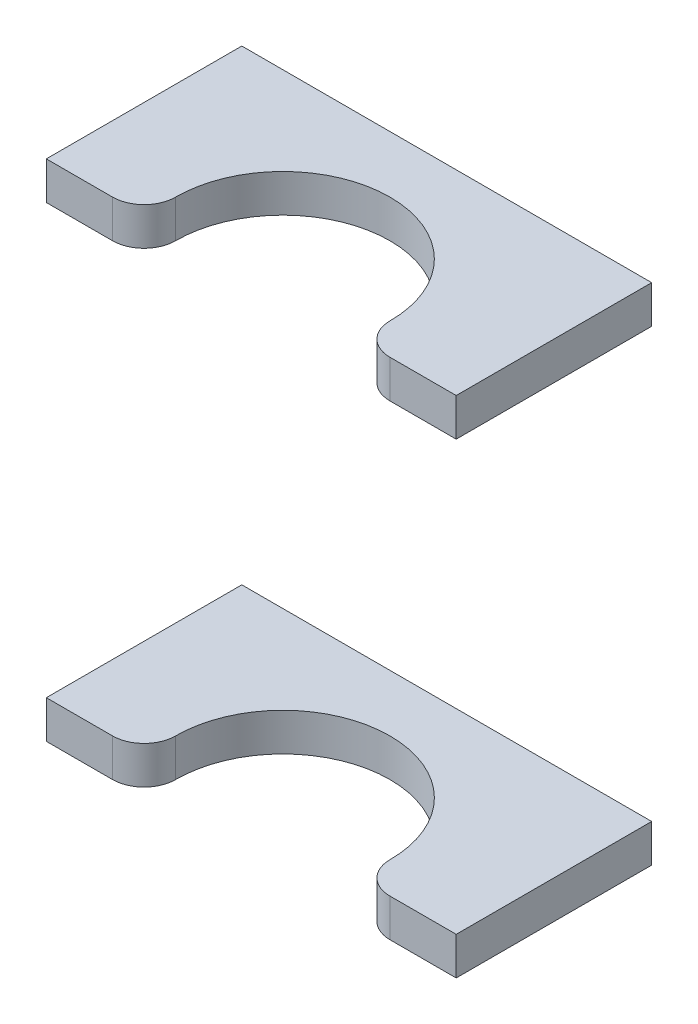
ISO-10303-21;
HEADER;
FILE_DESCRIPTION(('STEP AP214'),'2;1');
FILE_NAME('part.step','',(''),(''),'','','');
FILE_SCHEMA(('AUTOMOTIVE_DESIGN { 1 0 10303 214 1 1 1 1 }'));
ENDSEC;
DATA;
#1=APPLICATION_CONTEXT('core data for automotive mechanical design processes');
#2=APPLICATION_PROTOCOL_DEFINITION('international standard','automotive_design',2000,#1);
#3=PRODUCT_CONTEXT('',#1,'mechanical');
#4=PRODUCT('Part','Part','',(#3));
#5=PRODUCT_RELATED_PRODUCT_CATEGORY('part','',(#4));
#6=PRODUCT_DEFINITION_FORMATION('','',#4);
#7=PRODUCT_DEFINITION_CONTEXT('part definition',#1,'design');
#8=PRODUCT_DEFINITION('design','',#6,#7);
#9=PRODUCT_DEFINITION_SHAPE('','',#8);
#10=(LENGTH_UNIT() NAMED_UNIT(*) SI_UNIT(.MILLI.,.METRE.));
#11=(NAMED_UNIT(*) PLANE_ANGLE_UNIT() SI_UNIT($,.RADIAN.));
#12=(NAMED_UNIT(*) SI_UNIT($,.STERADIAN.) SOLID_ANGLE_UNIT());
#13=UNCERTAINTY_MEASURE_WITH_UNIT(LENGTH_MEASURE(1.E-05),#10,'distance_accuracy_value','');
#14=(GEOMETRIC_REPRESENTATION_CONTEXT(3) GLOBAL_UNCERTAINTY_ASSIGNED_CONTEXT((#13)) GLOBAL_UNIT_ASSIGNED_CONTEXT((#10,
#11,#12)) REPRESENTATION_CONTEXT('',''));
#15=CARTESIAN_POINT('',(0.,0.,0.));
#16=DIRECTION('',(0.,0.,1.));
#17=DIRECTION('',(1.,0.,0.));
#18=AXIS2_PLACEMENT_3D('',#15,#16,#17);
#19=CARTESIAN_POINT('',(-315.,100.,111.27633568147));
#20=DIRECTION('',(-1.,0.,0.));
#21=DIRECTION('',(0.,0.,1.));
#22=AXIS2_PLACEMENT_3D('',#19,#20,#21);
#23=PLANE('',#22);
#24=DIRECTION('',(0.,0.,-1.));
#25=VECTOR('',#24,1.);
#26=CARTESIAN_POINT('',(-315.,100.,111.27633568147));
#27=LINE('',#26,#25);
#28=CARTESIAN_POINT('',(-315.,100.,30.9999999999993));
#29=VERTEX_POINT('',#28);
#30=CARTESIAN_POINT('',(-315.,100.,0.));
#31=VERTEX_POINT('',#30);
#32=EDGE_CURVE('E79',#29,#31,#27,.T.);
#33=ORIENTED_EDGE('',*,*,#32,.F.);
#34=DIRECTION('',(0.,-1.,0.));
#35=VECTOR('',#34,1.);
#36=CARTESIAN_POINT('',(-315.,100.,30.9999999999993));
#37=LINE('',#36,#35);
#38=CARTESIAN_POINT('',(-315.,94.,30.9999999999993));
#39=VERTEX_POINT('',#38);
#40=EDGE_CURVE('E131',#29,#39,#37,.T.);
#41=ORIENTED_EDGE('',*,*,#40,.T.);
#42=DIRECTION('',(0.,0.,-1.));
#43=VECTOR('',#42,1.);
#44=CARTESIAN_POINT('',(-315.,94.,111.27633568147));
#45=LINE('',#44,#43);
#46=CARTESIAN_POINT('',(-315.,94.,0.));
#47=VERTEX_POINT('',#46);
#48=EDGE_CURVE('E87',#39,#47,#45,.T.);
#49=ORIENTED_EDGE('',*,*,#48,.T.);
#50=DIRECTION('',(0.,1.,0.));
#51=VECTOR('',#50,1.);
#52=CARTESIAN_POINT('',(-315.,100.,0.));
#53=LINE('',#52,#51);
#54=EDGE_CURVE('E167',#47,#31,#53,.T.);
#55=ORIENTED_EDGE('',*,*,#54,.T.);
#56=EDGE_LOOP('',(#33,#41,#49,#55));
#57=FACE_BOUND('',#56,.T.);
#58=ADVANCED_FACE('F44',(#57),#23,.F.);
#59=CARTESIAN_POINT('',(-315.,100.,111.27633568147));
#60=DIRECTION('',(0.,-1.,0.));
#61=DIRECTION('',(1.,0.,0.));
#62=AXIS2_PLACEMENT_3D('',#59,#60,#61);
#63=PLANE('',#62);
#64=DIRECTION('',(0.,0.,-1.));
#65=VECTOR('',#64,1.);
#66=CARTESIAN_POINT('',(-380.,100.,111.27633568147));
#67=LINE('',#66,#65);
#68=CARTESIAN_POINT('',(-380.,100.,30.9999999999993));
#69=VERTEX_POINT('',#68);
#70=CARTESIAN_POINT('',(-380.,100.,0.));
#71=VERTEX_POINT('',#70);
#72=EDGE_CURVE('E164',#69,#71,#67,.T.);
#73=ORIENTED_EDGE('',*,*,#72,.F.);
#74=DIRECTION('',(1.,0.,0.));
#75=VECTOR('',#74,1.);
#76=CARTESIAN_POINT('',(-369.5,100.,30.9999999999993));
#77=LINE('',#76,#75);
#78=CARTESIAN_POINT('',(-369.5,100.,30.9999999999993));
#79=VERTEX_POINT('',#78);
#80=EDGE_CURVE('E136',#69,#79,#77,.T.);
#81=ORIENTED_EDGE('',*,*,#80,.T.);
#82=CARTESIAN_POINT('',(-369.5,100.,25.9999999999993));
#83=DIRECTION('',(0.,1.,0.));
#84=DIRECTION('',(1.,0.,0.));
#85=AXIS2_PLACEMENT_3D('',#82,#83,#84);
#86=CIRCLE('',#85,4.99999999999998);
#87=CARTESIAN_POINT('',(-364.5,100.,25.9999999999993));
#88=VERTEX_POINT('',#87);
#89=EDGE_CURVE('E146',#79,#88,#86,.T.);
#90=ORIENTED_EDGE('',*,*,#89,.T.);
#91=CARTESIAN_POINT('',(-347.5,100.,25.9999999999993));
#92=DIRECTION('',(0.,-1.,0.));
#93=DIRECTION('',(1.,0.,0.));
#94=AXIS2_PLACEMENT_3D('',#91,#92,#93);
#95=CIRCLE('',#94,17.);
#96=CARTESIAN_POINT('',(-330.5,100.,25.9999999999993));
#97=VERTEX_POINT('',#96);
#98=EDGE_CURVE('E132',#88,#97,#95,.T.);
#99=ORIENTED_EDGE('',*,*,#98,.T.);
#100=CARTESIAN_POINT('',(-325.5,100.,25.9999999999993));
#101=DIRECTION('',(0.,1.,0.));
#102=DIRECTION('',(-1.,0.,0.));
#103=AXIS2_PLACEMENT_3D('',#100,#101,#102);
#104=CIRCLE('',#103,4.99999999999998);
#105=CARTESIAN_POINT('',(-325.5,100.,30.9999999999993));
#106=VERTEX_POINT('',#105);
#107=EDGE_CURVE('E126',#97,#106,#104,.T.);
#108=ORIENTED_EDGE('',*,*,#107,.T.);
#109=DIRECTION('',(1.,0.,0.));
#110=VECTOR('',#109,1.);
#111=CARTESIAN_POINT('',(-325.5,100.,30.9999999999993));
#112=LINE('',#111,#110);
#113=EDGE_CURVE('E134',#106,#29,#112,.T.);
#114=ORIENTED_EDGE('',*,*,#113,.T.);
#115=ORIENTED_EDGE('',*,*,#32,.T.);
#116=DIRECTION('',(-1.,0.,0.));
#117=VECTOR('',#116,1.);
#118=CARTESIAN_POINT('',(-315.,100.,0.));
#119=LINE('',#118,#117);
#120=EDGE_CURVE('E165',#31,#71,#119,.T.);
#121=ORIENTED_EDGE('',*,*,#120,.T.);
#122=EDGE_LOOP('',(#73,#81,#90,#99,#108,#114,#115,#121));
#123=FACE_BOUND('',#122,.T.);
#124=ADVANCED_FACE('F139',(#123),#63,.F.);
#125=CARTESIAN_POINT('',(-380.,100.,111.27633568147));
#126=DIRECTION('',(1.,0.,0.));
#127=DIRECTION('',(0.,0.,-1.));
#128=AXIS2_PLACEMENT_3D('',#125,#126,#127);
#129=PLANE('',#128);
#130=DIRECTION('',(0.,0.,-1.));
#131=VECTOR('',#130,1.);
#132=CARTESIAN_POINT('',(-380.,94.,111.27633568147));
#133=LINE('',#132,#131);
#134=CARTESIAN_POINT('',(-380.,94.,30.9999999999993));
#135=VERTEX_POINT('',#134);
#136=CARTESIAN_POINT('',(-380.,94.,0.));
#137=VERTEX_POINT('',#136);
#138=EDGE_CURVE('E66',#135,#137,#133,.T.);
#139=ORIENTED_EDGE('',*,*,#138,.F.);
#140=DIRECTION('',(0.,-1.,0.));
#141=VECTOR('',#140,1.);
#142=CARTESIAN_POINT('',(-380.,100.,30.9999999999993));
#143=LINE('',#142,#141);
#144=EDGE_CURVE('E156',#69,#135,#143,.T.);
#145=ORIENTED_EDGE('',*,*,#144,.F.);
#146=ORIENTED_EDGE('',*,*,#72,.T.);
#147=DIRECTION('',(0.,-1.,0.));
#148=VECTOR('',#147,1.);
#149=CARTESIAN_POINT('',(-380.,100.,0.));
#150=LINE('',#149,#148);
#151=EDGE_CURVE('E162',#71,#137,#150,.T.);
#152=ORIENTED_EDGE('',*,*,#151,.T.);
#153=EDGE_LOOP('',(#139,#145,#146,#152));
#154=FACE_BOUND('',#153,.T.);
#155=ADVANCED_FACE('F185',(#154),#129,.F.);
#156=CARTESIAN_POINT('',(-315.,94.,111.27633568147));
#157=DIRECTION('',(0.,1.,0.));
#158=DIRECTION('',(0.,0.,1.));
#159=AXIS2_PLACEMENT_3D('',#156,#157,#158);
#160=PLANE('',#159);
#161=CARTESIAN_POINT('',(-369.5,94.,25.9999999999993));
#162=DIRECTION('',(0.,1.,0.));
#163=DIRECTION('',(0.,0.,1.));
#164=AXIS2_PLACEMENT_3D('',#161,#162,#163);
#165=CIRCLE('',#164,4.99999999999998);
#166=CARTESIAN_POINT('',(-364.5,94.,25.9999999999993));
#167=VERTEX_POINT('',#166);
#168=CARTESIAN_POINT('',(-369.5,94.,30.9999999999993));
#169=VERTEX_POINT('',#168);
#170=EDGE_CURVE('E51',#167,#169,#165,.F.);
#171=ORIENTED_EDGE('',*,*,#170,.T.);
#172=DIRECTION('',(-1.,0.,0.));
#173=VECTOR('',#172,1.);
#174=CARTESIAN_POINT('',(-315.,94.,30.9999999999994));
#175=LINE('',#174,#173);
#176=EDGE_CURVE('E12',#169,#135,#175,.T.);
#177=ORIENTED_EDGE('',*,*,#176,.T.);
#178=ORIENTED_EDGE('',*,*,#138,.T.);
#179=DIRECTION('',(1.,0.,0.));
#180=VECTOR('',#179,1.);
#181=CARTESIAN_POINT('',(-315.,94.,0.));
#182=LINE('',#181,#180);
#183=EDGE_CURVE('E159',#137,#47,#182,.T.);
#184=ORIENTED_EDGE('',*,*,#183,.T.);
#185=ORIENTED_EDGE('',*,*,#48,.F.);
#186=DIRECTION('',(-1.,0.,0.));
#187=VECTOR('',#186,1.);
#188=CARTESIAN_POINT('',(-315.,94.,30.9999999999993));
#189=LINE('',#188,#187);
#190=CARTESIAN_POINT('',(-325.5,94.,30.9999999999993));
#191=VERTEX_POINT('',#190);
#192=EDGE_CURVE('E161',#39,#191,#189,.T.);
#193=ORIENTED_EDGE('',*,*,#192,.T.);
#194=CARTESIAN_POINT('',(-325.5,94.,25.9999999999993));
#195=DIRECTION('',(0.,1.,0.));
#196=DIRECTION('',(0.,0.,1.));
#197=AXIS2_PLACEMENT_3D('',#194,#195,#196);
#198=CIRCLE('',#197,4.99999999999998);
#199=CARTESIAN_POINT('',(-330.5,94.,25.9999999999993));
#200=VERTEX_POINT('',#199);
#201=EDGE_CURVE('E129',#191,#200,#198,.F.);
#202=ORIENTED_EDGE('',*,*,#201,.T.);
#203=CARTESIAN_POINT('',(-347.5,94.,25.9999999999993));
#204=DIRECTION('',(0.,1.,0.));
#205=DIRECTION('',(0.,0.,1.));
#206=AXIS2_PLACEMENT_3D('',#203,#204,#205);
#207=CIRCLE('',#206,17.);
#208=EDGE_CURVE('E94',#200,#167,#207,.T.);
#209=ORIENTED_EDGE('',*,*,#208,.T.);
#210=EDGE_LOOP('',(#171,#177,#178,#184,#185,#193,#202,#209));
#211=FACE_BOUND('',#210,.T.);
#212=ADVANCED_FACE('F176',(#211),#160,.F.);
#213=CARTESIAN_POINT('',(0.,0.,0.));
#214=DIRECTION('',(0.,0.,-1.));
#215=DIRECTION('',(-1.,0.,0.));
#216=AXIS2_PLACEMENT_3D('',#213,#214,#215);
#217=PLANE('',#216);
#218=ORIENTED_EDGE('',*,*,#54,.F.);
#219=ORIENTED_EDGE('',*,*,#183,.F.);
#220=ORIENTED_EDGE('',*,*,#151,.F.);
#221=ORIENTED_EDGE('',*,*,#120,.F.);
#222=EDGE_LOOP('',(#218,#219,#220,#221));
#223=FACE_BOUND('',#222,.T.);
#224=ADVANCED_FACE('F190',(#223),#217,.T.);
#225=CARTESIAN_POINT('',(-325.5,100.,25.9999999999993));
#226=DIRECTION('',(0.,-1.,0.));
#227=DIRECTION('',(1.,0.,0.));
#228=AXIS2_PLACEMENT_3D('',#225,#226,#227);
#229=CYLINDRICAL_SURFACE('',#228,4.99999999999998);
#230=DIRECTION('',(0.,-1.,0.));
#231=VECTOR('',#230,1.);
#232=CARTESIAN_POINT('',(-325.5,100.,30.9999999999993));
#233=LINE('',#232,#231);
#234=EDGE_CURVE('E58',#106,#191,#233,.T.);
#235=ORIENTED_EDGE('',*,*,#234,.F.);
#236=ORIENTED_EDGE('',*,*,#107,.F.);
#237=DIRECTION('',(0.,-1.,0.));
#238=VECTOR('',#237,1.);
#239=CARTESIAN_POINT('',(-330.5,100.,25.9999999999993));
#240=LINE('',#239,#238);
#241=EDGE_CURVE('E149',#97,#200,#240,.T.);
#242=ORIENTED_EDGE('',*,*,#241,.T.);
#243=ORIENTED_EDGE('',*,*,#201,.F.);
#244=EDGE_LOOP('',(#235,#236,#242,#243));
#245=FACE_BOUND('',#244,.T.);
#246=ADVANCED_FACE('F124',(#245),#229,.T.);
#247=CARTESIAN_POINT('',(-347.5,100.,25.9999999999993));
#248=DIRECTION('',(0.,-1.,0.));
#249=DIRECTION('',(1.,0.,0.));
#250=AXIS2_PLACEMENT_3D('',#247,#248,#249);
#251=CYLINDRICAL_SURFACE('',#250,17.);
#252=ORIENTED_EDGE('',*,*,#241,.F.);
#253=ORIENTED_EDGE('',*,*,#98,.F.);
#254=DIRECTION('',(0.,-1.,0.));
#255=VECTOR('',#254,1.);
#256=CARTESIAN_POINT('',(-364.5,100.,25.9999999999993));
#257=LINE('',#256,#255);
#258=EDGE_CURVE('E151',#88,#167,#257,.T.);
#259=ORIENTED_EDGE('',*,*,#258,.T.);
#260=ORIENTED_EDGE('',*,*,#208,.F.);
#261=EDGE_LOOP('',(#252,#253,#259,#260));
#262=FACE_BOUND('',#261,.T.);
#263=ADVANCED_FACE('F180',(#262),#251,.F.);
#264=CARTESIAN_POINT('',(-369.5,100.,25.9999999999993));
#265=DIRECTION('',(0.,-1.,0.));
#266=DIRECTION('',(1.,0.,0.));
#267=AXIS2_PLACEMENT_3D('',#264,#265,#266);
#268=CYLINDRICAL_SURFACE('',#267,4.99999999999998);
#269=ORIENTED_EDGE('',*,*,#258,.F.);
#270=ORIENTED_EDGE('',*,*,#89,.F.);
#271=DIRECTION('',(0.,-1.,0.));
#272=VECTOR('',#271,1.);
#273=CARTESIAN_POINT('',(-369.5,100.,30.9999999999993));
#274=LINE('',#273,#272);
#275=EDGE_CURVE('E153',#79,#169,#274,.T.);
#276=ORIENTED_EDGE('',*,*,#275,.T.);
#277=ORIENTED_EDGE('',*,*,#170,.F.);
#278=EDGE_LOOP('',(#269,#270,#276,#277));
#279=FACE_BOUND('',#278,.T.);
#280=ADVANCED_FACE('F178',(#279),#268,.T.);
#281=CARTESIAN_POINT('',(-369.5,100.,30.9999999999993));
#282=DIRECTION('',(0.,0.,-1.));
#283=DIRECTION('',(-1.,0.,0.));
#284=AXIS2_PLACEMENT_3D('',#281,#282,#283);
#285=PLANE('',#284);
#286=ORIENTED_EDGE('',*,*,#275,.F.);
#287=ORIENTED_EDGE('',*,*,#80,.F.);
#288=ORIENTED_EDGE('',*,*,#144,.T.);
#289=ORIENTED_EDGE('',*,*,#176,.F.);
#290=EDGE_LOOP('',(#286,#287,#288,#289));
#291=FACE_BOUND('',#290,.T.);
#292=ADVANCED_FACE('F183',(#291),#285,.F.);
#293=CARTESIAN_POINT('',(-325.5,100.,30.9999999999993));
#294=DIRECTION('',(0.,0.,-1.));
#295=DIRECTION('',(-1.,0.,0.));
#296=AXIS2_PLACEMENT_3D('',#293,#294,#295);
#297=PLANE('',#296);
#298=ORIENTED_EDGE('',*,*,#40,.F.);
#299=ORIENTED_EDGE('',*,*,#113,.F.);
#300=ORIENTED_EDGE('',*,*,#234,.T.);
#301=ORIENTED_EDGE('',*,*,#192,.F.);
#302=EDGE_LOOP('',(#298,#299,#300,#301));
#303=FACE_BOUND('',#302,.T.);
#304=ADVANCED_FACE('F135',(#303),#297,.F.);
#305=CLOSED_SHELL('',(#58,#124,#155,#212,#224,#246,#263,#280,#292,#304));
#306=MANIFOLD_SOLID_BREP('B2',#305);
#307=CARTESIAN_POINT('',(-380.,20.,111.27633568147));
#308=DIRECTION('',(1.,0.,0.));
#309=DIRECTION('',(0.,0.,-1.));
#310=AXIS2_PLACEMENT_3D('',#307,#308,#309);
#311=PLANE('',#310);
#312=DIRECTION('',(0.,0.,-1.));
#313=VECTOR('',#312,1.);
#314=CARTESIAN_POINT('',(-380.,20.,111.27633568147));
#315=LINE('',#314,#313);
#316=CARTESIAN_POINT('',(-380.,20.,30.9999999999993));
#317=VERTEX_POINT('',#316);
#318=CARTESIAN_POINT('',(-380.,20.,0.));
#319=VERTEX_POINT('',#318);
#320=EDGE_CURVE('E306',#317,#319,#315,.T.);
#321=ORIENTED_EDGE('',*,*,#320,.F.);
#322=DIRECTION('',(0.,-1.,0.));
#323=VECTOR('',#322,1.);
#324=CARTESIAN_POINT('',(-380.,100.,30.9999999999993));
#325=LINE('',#324,#323);
#326=CARTESIAN_POINT('',(-380.,26.,30.9999999999993));
#327=VERTEX_POINT('',#326);
#328=EDGE_CURVE('E382',#327,#317,#325,.T.);
#329=ORIENTED_EDGE('',*,*,#328,.F.);
#330=DIRECTION('',(0.,0.,-1.));
#331=VECTOR('',#330,1.);
#332=CARTESIAN_POINT('',(-380.,26.,111.27633568147));
#333=LINE('',#332,#331);
#334=CARTESIAN_POINT('',(-380.,26.,0.));
#335=VERTEX_POINT('',#334);
#336=EDGE_CURVE('E314',#327,#335,#333,.T.);
#337=ORIENTED_EDGE('',*,*,#336,.T.);
#338=DIRECTION('',(0.,-1.,0.));
#339=VECTOR('',#338,1.);
#340=CARTESIAN_POINT('',(-380.,20.,0.));
#341=LINE('',#340,#339);
#342=EDGE_CURVE('E391',#335,#319,#341,.T.);
#343=ORIENTED_EDGE('',*,*,#342,.T.);
#344=EDGE_LOOP('',(#321,#329,#337,#343));
#345=FACE_BOUND('',#344,.T.);
#346=ADVANCED_FACE('F271',(#345),#311,.F.);
#347=CARTESIAN_POINT('',(-315.,20.,111.27633568147));
#348=DIRECTION('',(0.,1.,0.));
#349=DIRECTION('',(-1.,0.,0.));
#350=AXIS2_PLACEMENT_3D('',#347,#348,#349);
#351=PLANE('',#350);
#352=CARTESIAN_POINT('',(-369.5,20.,25.9999999999993));
#353=DIRECTION('',(0.,1.,0.));
#354=DIRECTION('',(1.,0.,0.));
#355=AXIS2_PLACEMENT_3D('',#352,#353,#354);
#356=CIRCLE('',#355,4.99999999999998);
#357=CARTESIAN_POINT('',(-369.5,20.,30.9999999999993));
#358=VERTEX_POINT('',#357);
#359=CARTESIAN_POINT('',(-364.5,20.,25.9999999999993));
#360=VERTEX_POINT('',#359);
#361=EDGE_CURVE('E371',#358,#360,#356,.T.);
#362=ORIENTED_EDGE('',*,*,#361,.F.);
#363=DIRECTION('',(1.,0.,0.));
#364=VECTOR('',#363,1.);
#365=CARTESIAN_POINT('',(-369.5,20.,30.9999999999993));
#366=LINE('',#365,#364);
#367=EDGE_CURVE('E368',#317,#358,#366,.T.);
#368=ORIENTED_EDGE('',*,*,#367,.F.);
#369=ORIENTED_EDGE('',*,*,#320,.T.);
#370=DIRECTION('',(1.,0.,0.));
#371=VECTOR('',#370,1.);
#372=CARTESIAN_POINT('',(-315.,20.,0.));
#373=LINE('',#372,#371);
#374=CARTESIAN_POINT('',(-315.,20.,0.));
#375=VERTEX_POINT('',#374);
#376=EDGE_CURVE('E389',#319,#375,#373,.T.);
#377=ORIENTED_EDGE('',*,*,#376,.T.);
#378=DIRECTION('',(0.,0.,-1.));
#379=VECTOR('',#378,1.);
#380=CARTESIAN_POINT('',(-315.,20.,111.27633568147));
#381=LINE('',#380,#379);
#382=CARTESIAN_POINT('',(-315.,20.,30.9999999999993));
#383=VERTEX_POINT('',#382);
#384=EDGE_CURVE('E367',#383,#375,#381,.T.);
#385=ORIENTED_EDGE('',*,*,#384,.F.);
#386=DIRECTION('',(1.,0.,0.));
#387=VECTOR('',#386,1.);
#388=CARTESIAN_POINT('',(-325.5,20.,30.9999999999993));
#389=LINE('',#388,#387);
#390=CARTESIAN_POINT('',(-325.5,20.,30.9999999999993));
#391=VERTEX_POINT('',#390);
#392=EDGE_CURVE('E353',#391,#383,#389,.T.);
#393=ORIENTED_EDGE('',*,*,#392,.F.);
#394=CARTESIAN_POINT('',(-325.5,20.,25.9999999999993));
#395=DIRECTION('',(0.,1.,0.));
#396=DIRECTION('',(-1.,0.,0.));
#397=AXIS2_PLACEMENT_3D('',#394,#395,#396);
#398=CIRCLE('',#397,4.99999999999998);
#399=CARTESIAN_POINT('',(-330.5,20.,25.9999999999993));
#400=VERTEX_POINT('',#399);
#401=EDGE_CURVE('E358',#400,#391,#398,.T.);
#402=ORIENTED_EDGE('',*,*,#401,.F.);
#403=CARTESIAN_POINT('',(-347.5,20.,25.9999999999993));
#404=DIRECTION('',(0.,-1.,0.));
#405=DIRECTION('',(1.,0.,0.));
#406=AXIS2_PLACEMENT_3D('',#403,#404,#405);
#407=CIRCLE('',#406,17.);
#408=EDGE_CURVE('E355',#360,#400,#407,.T.);
#409=ORIENTED_EDGE('',*,*,#408,.F.);
#410=EDGE_LOOP('',(#362,#368,#369,#377,#385,#393,#402,#409));
#411=FACE_BOUND('',#410,.T.);
#412=ADVANCED_FACE('F366',(#411),#351,.F.);
#413=CARTESIAN_POINT('',(-315.,20.,111.27633568147));
#414=DIRECTION('',(-1.,0.,0.));
#415=DIRECTION('',(0.,0.,1.));
#416=AXIS2_PLACEMENT_3D('',#413,#414,#415);
#417=PLANE('',#416);
#418=DIRECTION('',(0.,0.,-1.));
#419=VECTOR('',#418,1.);
#420=CARTESIAN_POINT('',(-315.,26.,111.27633568147));
#421=LINE('',#420,#419);
#422=CARTESIAN_POINT('',(-315.,26.,30.9999999999993));
#423=VERTEX_POINT('',#422);
#424=CARTESIAN_POINT('',(-315.,26.,0.));
#425=VERTEX_POINT('',#424);
#426=EDGE_CURVE('E293',#423,#425,#421,.T.);
#427=ORIENTED_EDGE('',*,*,#426,.F.);
#428=DIRECTION('',(0.,-1.,0.));
#429=VECTOR('',#428,1.);
#430=CARTESIAN_POINT('',(-315.,100.,30.9999999999993));
#431=LINE('',#430,#429);
#432=EDGE_CURVE('E285',#423,#383,#431,.T.);
#433=ORIENTED_EDGE('',*,*,#432,.T.);
#434=ORIENTED_EDGE('',*,*,#384,.T.);
#435=DIRECTION('',(0.,1.,0.));
#436=VECTOR('',#435,1.);
#437=CARTESIAN_POINT('',(-315.,20.,0.));
#438=LINE('',#437,#436);
#439=EDGE_CURVE('E387',#375,#425,#438,.T.);
#440=ORIENTED_EDGE('',*,*,#439,.T.);
#441=EDGE_LOOP('',(#427,#433,#434,#440));
#442=FACE_BOUND('',#441,.T.);
#443=ADVANCED_FACE('F424',(#442),#417,.F.);
#444=CARTESIAN_POINT('',(-315.,26.,111.27633568147));
#445=DIRECTION('',(0.,-1.,0.));
#446=DIRECTION('',(1.,0.,0.));
#447=AXIS2_PLACEMENT_3D('',#444,#445,#446);
#448=PLANE('',#447);
#449=ORIENTED_EDGE('',*,*,#336,.F.);
#450=DIRECTION('',(1.,0.,0.));
#451=VECTOR('',#450,1.);
#452=CARTESIAN_POINT('',(-315.,26.,30.9999999999994));
#453=LINE('',#452,#451);
#454=CARTESIAN_POINT('',(-369.5,26.,30.9999999999993));
#455=VERTEX_POINT('',#454);
#456=EDGE_CURVE('E42',#327,#455,#453,.T.);
#457=ORIENTED_EDGE('',*,*,#456,.T.);
#458=CARTESIAN_POINT('',(-369.5,26.,25.9999999999993));
#459=DIRECTION('',(0.,-1.,0.));
#460=DIRECTION('',(1.,0.,0.));
#461=AXIS2_PLACEMENT_3D('',#458,#459,#460);
#462=CIRCLE('',#461,4.99999999999998);
#463=CARTESIAN_POINT('',(-364.5,26.,25.9999999999993));
#464=VERTEX_POINT('',#463);
#465=EDGE_CURVE('E278',#455,#464,#462,.F.);
#466=ORIENTED_EDGE('',*,*,#465,.T.);
#467=CARTESIAN_POINT('',(-347.5,26.,25.9999999999993));
#468=DIRECTION('',(0.,-1.,0.));
#469=DIRECTION('',(1.,0.,0.));
#470=AXIS2_PLACEMENT_3D('',#467,#468,#469);
#471=CIRCLE('',#470,17.);
#472=CARTESIAN_POINT('',(-330.5,26.,25.9999999999993));
#473=VERTEX_POINT('',#472);
#474=EDGE_CURVE('E399',#464,#473,#471,.T.);
#475=ORIENTED_EDGE('',*,*,#474,.T.);
#476=CARTESIAN_POINT('',(-325.5,26.,25.9999999999993));
#477=DIRECTION('',(0.,-1.,0.));
#478=DIRECTION('',(1.,0.,0.));
#479=AXIS2_PLACEMENT_3D('',#476,#477,#478);
#480=CIRCLE('',#479,4.99999999999998);
#481=CARTESIAN_POINT('',(-325.5,26.,30.9999999999993));
#482=VERTEX_POINT('',#481);
#483=EDGE_CURVE('E321',#473,#482,#480,.F.);
#484=ORIENTED_EDGE('',*,*,#483,.T.);
#485=DIRECTION('',(1.,0.,0.));
#486=VECTOR('',#485,1.);
#487=CARTESIAN_POINT('',(-315.,26.,30.9999999999993));
#488=LINE('',#487,#486);
#489=EDGE_CURVE('E354',#482,#423,#488,.T.);
#490=ORIENTED_EDGE('',*,*,#489,.T.);
#491=ORIENTED_EDGE('',*,*,#426,.T.);
#492=DIRECTION('',(-1.,0.,0.));
#493=VECTOR('',#492,1.);
#494=CARTESIAN_POINT('',(-315.,26.,0.));
#495=LINE('',#494,#493);
#496=EDGE_CURVE('E385',#425,#335,#495,.T.);
#497=ORIENTED_EDGE('',*,*,#496,.T.);
#498=EDGE_LOOP('',(#449,#457,#466,#475,#484,#490,#491,#497));
#499=FACE_BOUND('',#498,.T.);
#500=ADVANCED_FACE('F402',(#499),#448,.F.);
#501=CARTESIAN_POINT('',(0.,0.,0.));
#502=DIRECTION('',(0.,0.,1.));
#503=DIRECTION('',(1.,0.,0.));
#504=AXIS2_PLACEMENT_3D('',#501,#502,#503);
#505=PLANE('',#504);
#506=ORIENTED_EDGE('',*,*,#342,.F.);
#507=ORIENTED_EDGE('',*,*,#496,.F.);
#508=ORIENTED_EDGE('',*,*,#439,.F.);
#509=ORIENTED_EDGE('',*,*,#376,.F.);
#510=EDGE_LOOP('',(#506,#507,#508,#509));
#511=FACE_BOUND('',#510,.T.);
#512=ADVANCED_FACE('F418',(#511),#505,.F.);
#513=CARTESIAN_POINT('',(-325.5,100.,25.9999999999993));
#514=DIRECTION('',(0.,-1.,0.));
#515=DIRECTION('',(1.,0.,0.));
#516=AXIS2_PLACEMENT_3D('',#513,#514,#515);
#517=CYLINDRICAL_SURFACE('',#516,4.99999999999998);
#518=DIRECTION('',(0.,-1.,0.));
#519=VECTOR('',#518,1.);
#520=CARTESIAN_POINT('',(-330.5,100.,25.9999999999993));
#521=LINE('',#520,#519);
#522=EDGE_CURVE('E360',#473,#400,#521,.T.);
#523=ORIENTED_EDGE('',*,*,#522,.T.);
#524=ORIENTED_EDGE('',*,*,#401,.T.);
#525=DIRECTION('',(0.,-1.,0.));
#526=VECTOR('',#525,1.);
#527=CARTESIAN_POINT('',(-325.5,100.,30.9999999999993));
#528=LINE('',#527,#526);
#529=EDGE_CURVE('E349',#482,#391,#528,.T.);
#530=ORIENTED_EDGE('',*,*,#529,.F.);
#531=ORIENTED_EDGE('',*,*,#483,.F.);
#532=EDGE_LOOP('',(#523,#524,#530,#531));
#533=FACE_BOUND('',#532,.T.);
#534=ADVANCED_FACE('F359',(#533),#517,.T.);
#535=CARTESIAN_POINT('',(-347.5,100.,25.9999999999993));
#536=DIRECTION('',(0.,-1.,0.));
#537=DIRECTION('',(1.,0.,0.));
#538=AXIS2_PLACEMENT_3D('',#535,#536,#537);
#539=CYLINDRICAL_SURFACE('',#538,17.);
#540=DIRECTION('',(0.,-1.,0.));
#541=VECTOR('',#540,1.);
#542=CARTESIAN_POINT('',(-364.5,100.,25.9999999999993));
#543=LINE('',#542,#541);
#544=EDGE_CURVE('E378',#464,#360,#543,.T.);
#545=ORIENTED_EDGE('',*,*,#544,.T.);
#546=ORIENTED_EDGE('',*,*,#408,.T.);
#547=ORIENTED_EDGE('',*,*,#522,.F.);
#548=ORIENTED_EDGE('',*,*,#474,.F.);
#549=EDGE_LOOP('',(#545,#546,#547,#548));
#550=FACE_BOUND('',#549,.T.);
#551=ADVANCED_FACE('F410',(#550),#539,.F.);
#552=CARTESIAN_POINT('',(-369.5,100.,25.9999999999993));
#553=DIRECTION('',(0.,-1.,0.));
#554=DIRECTION('',(1.,0.,0.));
#555=AXIS2_PLACEMENT_3D('',#552,#553,#554);
#556=CYLINDRICAL_SURFACE('',#555,4.99999999999998);
#557=DIRECTION('',(0.,-1.,0.));
#558=VECTOR('',#557,1.);
#559=CARTESIAN_POINT('',(-369.5,100.,30.9999999999993));
#560=LINE('',#559,#558);
#561=EDGE_CURVE('E380',#455,#358,#560,.T.);
#562=ORIENTED_EDGE('',*,*,#561,.T.);
#563=ORIENTED_EDGE('',*,*,#361,.T.);
#564=ORIENTED_EDGE('',*,*,#544,.F.);
#565=ORIENTED_EDGE('',*,*,#465,.F.);
#566=EDGE_LOOP('',(#562,#563,#564,#565));
#567=FACE_BOUND('',#566,.T.);
#568=ADVANCED_FACE('F406',(#567),#556,.T.);
#569=CARTESIAN_POINT('',(-369.5,100.,30.9999999999993));
#570=DIRECTION('',(0.,0.,-1.));
#571=DIRECTION('',(-1.,0.,0.));
#572=AXIS2_PLACEMENT_3D('',#569,#570,#571);
#573=PLANE('',#572);
#574=ORIENTED_EDGE('',*,*,#328,.T.);
#575=ORIENTED_EDGE('',*,*,#367,.T.);
#576=ORIENTED_EDGE('',*,*,#561,.F.);
#577=ORIENTED_EDGE('',*,*,#456,.F.);
#578=EDGE_LOOP('',(#574,#575,#576,#577));
#579=FACE_BOUND('',#578,.T.);
#580=ADVANCED_FACE('F408',(#579),#573,.F.);
#581=CARTESIAN_POINT('',(-325.5,100.,30.9999999999993));
#582=DIRECTION('',(0.,0.,-1.));
#583=DIRECTION('',(-1.,0.,0.));
#584=AXIS2_PLACEMENT_3D('',#581,#582,#583);
#585=PLANE('',#584);
#586=ORIENTED_EDGE('',*,*,#529,.T.);
#587=ORIENTED_EDGE('',*,*,#392,.T.);
#588=ORIENTED_EDGE('',*,*,#432,.F.);
#589=ORIENTED_EDGE('',*,*,#489,.F.);
#590=EDGE_LOOP('',(#586,#587,#588,#589));
#591=FACE_BOUND('',#590,.T.);
#592=ADVANCED_FACE('F351',(#591),#585,.F.);
#593=CLOSED_SHELL('',(#346,#412,#443,#500,#512,#534,#551,#568,#580,#592));
#594=MANIFOLD_SOLID_BREP('B6',#593);
#595=ADVANCED_BREP_SHAPE_REPRESENTATION('',(#18,#306,#594),#14);
#596=SHAPE_DEFINITION_REPRESENTATION(#9,#595);
ENDSEC;
END-ISO-10303-21;
